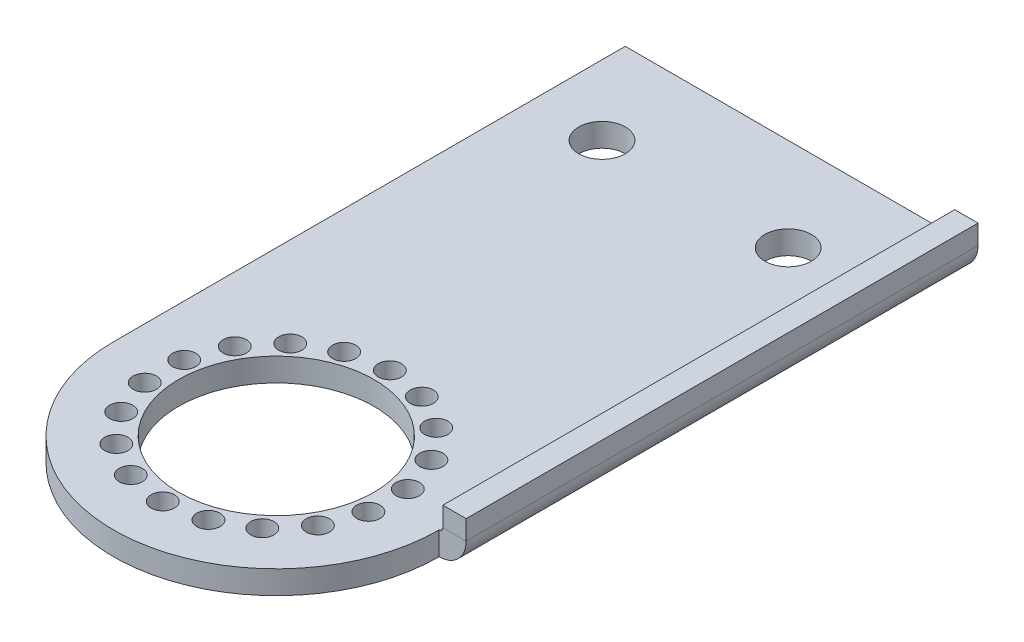
ISO-10303-21;
HEADER;
FILE_DESCRIPTION(('STEP AP214'),'2;1');
FILE_NAME('part.step','',(''),(''),'','','');
FILE_SCHEMA(('AUTOMOTIVE_DESIGN { 1 0 10303 214 1 1 1 1 }'));
ENDSEC;
DATA;
#1=APPLICATION_CONTEXT('core data for automotive mechanical design processes');
#2=APPLICATION_PROTOCOL_DEFINITION('international standard','automotive_design',2000,#1);
#3=PRODUCT_CONTEXT('',#1,'mechanical');
#4=PRODUCT('Part','Part','',(#3));
#5=PRODUCT_RELATED_PRODUCT_CATEGORY('part','',(#4));
#6=PRODUCT_DEFINITION_FORMATION('','',#4);
#7=PRODUCT_DEFINITION_CONTEXT('part definition',#1,'design');
#8=PRODUCT_DEFINITION('design','',#6,#7);
#9=PRODUCT_DEFINITION_SHAPE('','',#8);
#10=(LENGTH_UNIT() NAMED_UNIT(*) SI_UNIT(.MILLI.,.METRE.));
#11=(NAMED_UNIT(*) PLANE_ANGLE_UNIT() SI_UNIT($,.RADIAN.));
#12=(NAMED_UNIT(*) SI_UNIT($,.STERADIAN.) SOLID_ANGLE_UNIT());
#13=UNCERTAINTY_MEASURE_WITH_UNIT(LENGTH_MEASURE(1.E-05),#10,'distance_accuracy_value','');
#14=(GEOMETRIC_REPRESENTATION_CONTEXT(3) GLOBAL_UNCERTAINTY_ASSIGNED_CONTEXT((#13)) GLOBAL_UNIT_ASSIGNED_CONTEXT((#10,
#11,#12)) REPRESENTATION_CONTEXT('',''));
#15=CARTESIAN_POINT('',(0.,0.,0.));
#16=DIRECTION('',(0.,0.,1.));
#17=DIRECTION('',(1.,0.,0.));
#18=AXIS2_PLACEMENT_3D('',#15,#16,#17);
#19=CARTESIAN_POINT('',(22.225,3.175,-69.85));
#20=DIRECTION('',(0.,0.,1.));
#21=DIRECTION('',(-1.,0.,0.));
#22=AXIS2_PLACEMENT_3D('',#19,#20,#21);
#23=PLANE('',#22);
#24=DIRECTION('',(0.,1.,0.));
#25=VECTOR('',#24,1.);
#26=CARTESIAN_POINT('',(22.225,3.175,-69.85));
#27=LINE('',#26,#25);
#28=CARTESIAN_POINT('',(22.225,0.,-69.85));
#29=VERTEX_POINT('',#28);
#30=CARTESIAN_POINT('',(22.225,3.175,-69.85));
#31=VERTEX_POINT('',#30);
#32=EDGE_CURVE('E13',#29,#31,#27,.T.);
#33=ORIENTED_EDGE('',*,*,#32,.F.);
#34=DIRECTION('',(1.,0.,0.));
#35=VECTOR('',#34,1.);
#36=CARTESIAN_POINT('',(0.,0.,-69.85));
#37=LINE('',#36,#35);
#38=CARTESIAN_POINT('',(-22.225,0.,-69.85));
#39=VERTEX_POINT('',#38);
#40=EDGE_CURVE('E98',#29,#39,#37,.F.);
#41=ORIENTED_EDGE('',*,*,#40,.T.);
#42=DIRECTION('',(0.,1.,0.));
#43=VECTOR('',#42,1.);
#44=CARTESIAN_POINT('',(-22.225,3.175,-69.85));
#45=LINE('',#44,#43);
#46=CARTESIAN_POINT('',(-22.225,3.175,-69.85));
#47=VERTEX_POINT('',#46);
#48=EDGE_CURVE('E67',#39,#47,#45,.T.);
#49=ORIENTED_EDGE('',*,*,#48,.T.);
#50=DIRECTION('',(-1.,0.,0.));
#51=VECTOR('',#50,1.);
#52=CARTESIAN_POINT('',(22.225,3.175,-69.85));
#53=LINE('',#52,#51);
#54=EDGE_CURVE('E122',#31,#47,#53,.T.);
#55=ORIENTED_EDGE('',*,*,#54,.F.);
#56=EDGE_LOOP('',(#33,#41,#49,#55));
#57=FACE_BOUND('',#56,.T.);
#58=ADVANCED_FACE('F57',(#57),#23,.F.);
#59=CARTESIAN_POINT('',(-22.225,3.175,-69.85));
#60=DIRECTION('',(1.,0.,0.));
#61=DIRECTION('',(0.,0.,1.));
#62=AXIS2_PLACEMENT_3D('',#59,#60,#61);
#63=PLANE('',#62);
#64=ORIENTED_EDGE('',*,*,#48,.F.);
#65=DIRECTION('',(0.,0.,-1.));
#66=VECTOR('',#65,1.);
#67=CARTESIAN_POINT('',(-22.225,0.,0.));
#68=LINE('',#67,#66);
#69=CARTESIAN_POINT('',(-22.225,0.,0.));
#70=VERTEX_POINT('',#69);
#71=EDGE_CURVE('E282',#39,#70,#68,.F.);
#72=ORIENTED_EDGE('',*,*,#71,.T.);
#73=DIRECTION('',(0.,1.,0.));
#74=VECTOR('',#73,1.);
#75=CARTESIAN_POINT('',(-22.225,3.175,0.));
#76=LINE('',#75,#74);
#77=CARTESIAN_POINT('',(-22.225,3.175,0.));
#78=VERTEX_POINT('',#77);
#79=EDGE_CURVE('E75',#70,#78,#76,.T.);
#80=ORIENTED_EDGE('',*,*,#79,.T.);
#81=DIRECTION('',(0.,0.,1.));
#82=VECTOR('',#81,1.);
#83=CARTESIAN_POINT('',(-22.225,3.175,-69.85));
#84=LINE('',#83,#82);
#85=EDGE_CURVE('E130',#47,#78,#84,.T.);
#86=ORIENTED_EDGE('',*,*,#85,.F.);
#87=EDGE_LOOP('',(#64,#72,#80,#86));
#88=FACE_BOUND('',#87,.T.);
#89=ADVANCED_FACE('F363',(#88),#63,.F.);
#90=CARTESIAN_POINT('',(0.,3.175,0.));
#91=DIRECTION('',(0.,1.,0.));
#92=DIRECTION('',(0.,0.,1.));
#93=AXIS2_PLACEMENT_3D('',#90,#91,#92);
#94=CYLINDRICAL_SURFACE('',#93,22.225);
#95=ORIENTED_EDGE('',*,*,#79,.F.);
#96=CARTESIAN_POINT('',(0.,0.,0.));
#97=DIRECTION('',(0.,1.,0.));
#98=DIRECTION('',(0.,0.,1.));
#99=AXIS2_PLACEMENT_3D('',#96,#97,#98);
#100=CIRCLE('',#99,22.225);
#101=CARTESIAN_POINT('',(22.225,0.,0.));
#102=VERTEX_POINT('',#101);
#103=EDGE_CURVE('E280',#70,#102,#100,.T.);
#104=ORIENTED_EDGE('',*,*,#103,.T.);
#105=DIRECTION('',(0.,1.,0.));
#106=VECTOR('',#105,1.);
#107=CARTESIAN_POINT('',(22.225,3.175,0.));
#108=LINE('',#107,#106);
#109=CARTESIAN_POINT('',(22.225,3.175,0.));
#110=VERTEX_POINT('',#109);
#111=EDGE_CURVE('E61',#102,#110,#108,.T.);
#112=ORIENTED_EDGE('',*,*,#111,.T.);
#113=CARTESIAN_POINT('',(0.,3.175,0.));
#114=DIRECTION('',(0.,1.,0.));
#115=DIRECTION('',(0.,0.,-1.));
#116=AXIS2_PLACEMENT_3D('',#113,#114,#115);
#117=CIRCLE('',#116,22.225);
#118=EDGE_CURVE('E123',#78,#110,#117,.T.);
#119=ORIENTED_EDGE('',*,*,#118,.F.);
#120=EDGE_LOOP('',(#95,#104,#112,#119));
#121=FACE_BOUND('',#120,.T.);
#122=ADVANCED_FACE('F291',(#121),#94,.T.);
#123=CARTESIAN_POINT('',(-5.29926010068765,3.175,-14.5595974664571));
#124=DIRECTION('',(0.,1.,0.));
#125=DIRECTION('',(0.,0.,1.));
#126=AXIS2_PLACEMENT_3D('',#123,#124,#125);
#127=CYLINDRICAL_SURFACE('',#126,1.58749999999753);
#128=CARTESIAN_POINT('',(-5.29926010068765,3.175,-14.5595974664571));
#129=DIRECTION('',(0.,1.,0.));
#130=DIRECTION('',(0.,0.,1.));
#131=AXIS2_PLACEMENT_3D('',#128,#129,#130);
#132=CIRCLE('',#131,1.58749999999753);
#133=CARTESIAN_POINT('',(-5.29926010068765,3.175,-12.9720974664595));
#134=VERTEX_POINT('',#133);
#135=EDGE_CURVE('E153',#134,#134,#132,.T.);
#136=ORIENTED_EDGE('',*,*,#135,.T.);
#137=EDGE_LOOP('',(#136));
#138=FACE_BOUND('',#137,.T.);
#139=CARTESIAN_POINT('',(-5.29926010068765,0.,-14.5595974664571));
#140=DIRECTION('',(0.,1.,0.));
#141=DIRECTION('',(0.,0.,1.));
#142=AXIS2_PLACEMENT_3D('',#139,#140,#141);
#143=CIRCLE('',#142,1.58749999999753);
#144=CARTESIAN_POINT('',(-5.29926010068765,0.,-12.9720974664595));
#145=VERTEX_POINT('',#144);
#146=EDGE_CURVE('E219',#145,#145,#143,.T.);
#147=ORIENTED_EDGE('',*,*,#146,.F.);
#148=EDGE_LOOP('',(#147));
#149=FACE_BOUND('',#148,.T.);
#150=ADVANCED_FACE('F372',(#138,#149),#127,.F.);
#151=CARTESIAN_POINT('',(-9.95935122448306,3.175,-11.8690926016857));
#152=DIRECTION('',(0.,1.,0.));
#153=DIRECTION('',(0.,0.,1.));
#154=AXIS2_PLACEMENT_3D('',#151,#152,#153);
#155=CYLINDRICAL_SURFACE('',#154,1.58749999999747);
#156=CARTESIAN_POINT('',(-9.95935122448306,3.175,-11.8690926016857));
#157=DIRECTION('',(0.,1.,0.));
#158=DIRECTION('',(0.,0.,1.));
#159=AXIS2_PLACEMENT_3D('',#156,#157,#158);
#160=CIRCLE('',#159,1.58749999999747);
#161=CARTESIAN_POINT('',(-9.95935122448306,3.175,-10.2815926016882));
#162=VERTEX_POINT('',#161);
#163=EDGE_CURVE('E156',#162,#162,#160,.T.);
#164=ORIENTED_EDGE('',*,*,#163,.T.);
#165=EDGE_LOOP('',(#164));
#166=FACE_BOUND('',#165,.T.);
#167=CARTESIAN_POINT('',(-9.95935122448306,0.,-11.8690926016857));
#168=DIRECTION('',(0.,1.,0.));
#169=DIRECTION('',(0.,0.,1.));
#170=AXIS2_PLACEMENT_3D('',#167,#168,#169);
#171=CIRCLE('',#170,1.58749999999747);
#172=CARTESIAN_POINT('',(-9.95935122448306,0.,-10.2815926016882));
#173=VERTEX_POINT('',#172);
#174=EDGE_CURVE('E222',#173,#173,#171,.T.);
#175=ORIENTED_EDGE('',*,*,#174,.F.);
#176=EDGE_LOOP('',(#175));
#177=FACE_BOUND('',#176,.T.);
#178=ADVANCED_FACE('F444',(#166,#177),#155,.F.);
#179=CARTESIAN_POINT('',(-13.418197606236,3.175,-7.74700000000019));
#180=DIRECTION('',(0.,1.,0.));
#181=DIRECTION('',(0.,0.,1.));
#182=AXIS2_PLACEMENT_3D('',#179,#180,#181);
#183=CYLINDRICAL_SURFACE('',#182,1.58749999999742);
#184=CARTESIAN_POINT('',(-13.418197606236,3.175,-7.74700000000019));
#185=DIRECTION('',(0.,1.,0.));
#186=DIRECTION('',(0.,0.,1.));
#187=AXIS2_PLACEMENT_3D('',#184,#185,#186);
#188=CIRCLE('',#187,1.58749999999742);
#189=CARTESIAN_POINT('',(-13.418197606236,3.175,-6.15950000000278));
#190=VERTEX_POINT('',#189);
#191=EDGE_CURVE('E160',#190,#190,#188,.T.);
#192=ORIENTED_EDGE('',*,*,#191,.T.);
#193=EDGE_LOOP('',(#192));
#194=FACE_BOUND('',#193,.T.);
#195=CARTESIAN_POINT('',(-13.418197606236,0.,-7.74700000000019));
#196=DIRECTION('',(0.,1.,0.));
#197=DIRECTION('',(0.,0.,1.));
#198=AXIS2_PLACEMENT_3D('',#195,#196,#197);
#199=CIRCLE('',#198,1.58749999999742);
#200=CARTESIAN_POINT('',(-13.418197606236,0.,-6.15950000000278));
#201=VERTEX_POINT('',#200);
#202=EDGE_CURVE('E226',#201,#201,#199,.T.);
#203=ORIENTED_EDGE('',*,*,#202,.F.);
#204=EDGE_LOOP('',(#203));
#205=FACE_BOUND('',#204,.T.);
#206=ADVANCED_FACE('F440',(#194,#205),#183,.F.);
#207=CARTESIAN_POINT('',(-15.2586113251711,3.175,-2.69050486477159));
#208=DIRECTION('',(0.,1.,0.));
#209=DIRECTION('',(0.,0.,1.));
#210=AXIS2_PLACEMENT_3D('',#207,#208,#209);
#211=CYLINDRICAL_SURFACE('',#210,1.58749999999737);
#212=CARTESIAN_POINT('',(-15.2586113251711,3.175,-2.69050486477159));
#213=DIRECTION('',(0.,1.,0.));
#214=DIRECTION('',(0.,0.,1.));
#215=AXIS2_PLACEMENT_3D('',#212,#213,#214);
#216=CIRCLE('',#215,1.58749999999737);
#217=CARTESIAN_POINT('',(-15.2586113251711,3.175,-1.10300486477422));
#218=VERTEX_POINT('',#217);
#219=EDGE_CURVE('E163',#218,#218,#216,.T.);
#220=ORIENTED_EDGE('',*,*,#219,.T.);
#221=EDGE_LOOP('',(#220));
#222=FACE_BOUND('',#221,.T.);
#223=CARTESIAN_POINT('',(-15.2586113251711,0.,-2.69050486477159));
#224=DIRECTION('',(0.,1.,0.));
#225=DIRECTION('',(0.,0.,1.));
#226=AXIS2_PLACEMENT_3D('',#223,#224,#225);
#227=CIRCLE('',#226,1.58749999999737);
#228=CARTESIAN_POINT('',(-15.2586113251711,0.,-1.10300486477422));
#229=VERTEX_POINT('',#228);
#230=EDGE_CURVE('E229',#229,#229,#227,.T.);
#231=ORIENTED_EDGE('',*,*,#230,.F.);
#232=EDGE_LOOP('',(#231));
#233=FACE_BOUND('',#232,.T.);
#234=ADVANCED_FACE('F436',(#222,#233),#211,.F.);
#235=CARTESIAN_POINT('',(-15.2586113251711,3.175,2.69050486477106));
#236=DIRECTION('',(0.,1.,0.));
#237=DIRECTION('',(0.,0.,1.));
#238=AXIS2_PLACEMENT_3D('',#235,#236,#237);
#239=CYLINDRICAL_SURFACE('',#238,1.58749999999733);
#240=CARTESIAN_POINT('',(-15.2586113251711,3.175,2.69050486477106));
#241=DIRECTION('',(0.,1.,0.));
#242=DIRECTION('',(0.,0.,1.));
#243=AXIS2_PLACEMENT_3D('',#240,#241,#242);
#244=CIRCLE('',#243,1.58749999999733);
#245=CARTESIAN_POINT('',(-15.2586113251711,3.175,4.27800486476839));
#246=VERTEX_POINT('',#245);
#247=EDGE_CURVE('E166',#246,#246,#244,.T.);
#248=ORIENTED_EDGE('',*,*,#247,.T.);
#249=EDGE_LOOP('',(#248));
#250=FACE_BOUND('',#249,.T.);
#251=CARTESIAN_POINT('',(-15.2586113251711,0.,2.69050486477106));
#252=DIRECTION('',(0.,1.,0.));
#253=DIRECTION('',(0.,0.,1.));
#254=AXIS2_PLACEMENT_3D('',#251,#252,#253);
#255=CIRCLE('',#254,1.58749999999733);
#256=CARTESIAN_POINT('',(-15.2586113251711,0.,4.27800486476839));
#257=VERTEX_POINT('',#256);
#258=EDGE_CURVE('E232',#257,#257,#255,.T.);
#259=ORIENTED_EDGE('',*,*,#258,.F.);
#260=EDGE_LOOP('',(#259));
#261=FACE_BOUND('',#260,.T.);
#262=ADVANCED_FACE('F432',(#250,#261),#239,.F.);
#263=CARTESIAN_POINT('',(-13.4181976062361,3.175,7.74699999999968));
#264=DIRECTION('',(0.,1.,0.));
#265=DIRECTION('',(0.,0.,1.));
#266=AXIS2_PLACEMENT_3D('',#263,#264,#265);
#267=CYLINDRICAL_SURFACE('',#266,1.58749999999732);
#268=CARTESIAN_POINT('',(-13.4181976062361,3.175,7.74699999999968));
#269=DIRECTION('',(0.,1.,0.));
#270=DIRECTION('',(0.,0.,1.));
#271=AXIS2_PLACEMENT_3D('',#268,#269,#270);
#272=CIRCLE('',#271,1.58749999999732);
#273=CARTESIAN_POINT('',(-13.4181976062361,3.175,9.33449999999699));
#274=VERTEX_POINT('',#273);
#275=EDGE_CURVE('E169',#274,#274,#272,.T.);
#276=ORIENTED_EDGE('',*,*,#275,.T.);
#277=EDGE_LOOP('',(#276));
#278=FACE_BOUND('',#277,.T.);
#279=CARTESIAN_POINT('',(-13.4181976062361,0.,7.74699999999968));
#280=DIRECTION('',(0.,1.,0.));
#281=DIRECTION('',(0.,0.,1.));
#282=AXIS2_PLACEMENT_3D('',#279,#280,#281);
#283=CIRCLE('',#282,1.58749999999732);
#284=CARTESIAN_POINT('',(-13.4181976062361,0.,9.33449999999699));
#285=VERTEX_POINT('',#284);
#286=EDGE_CURVE('E235',#285,#285,#283,.T.);
#287=ORIENTED_EDGE('',*,*,#286,.F.);
#288=EDGE_LOOP('',(#287));
#289=FACE_BOUND('',#288,.T.);
#290=ADVANCED_FACE('F428',(#278,#289),#267,.F.);
#291=CARTESIAN_POINT('',(-9.95935122448335,3.175,11.8690926016852));
#292=DIRECTION('',(0.,1.,0.));
#293=DIRECTION('',(0.,0.,1.));
#294=AXIS2_PLACEMENT_3D('',#291,#292,#293);
#295=CYLINDRICAL_SURFACE('',#294,1.5874999999971);
#296=CARTESIAN_POINT('',(-9.95935122448335,3.175,11.8690926016852));
#297=DIRECTION('',(0.,1.,0.));
#298=DIRECTION('',(0.,0.,1.));
#299=AXIS2_PLACEMENT_3D('',#296,#297,#298);
#300=CIRCLE('',#299,1.5874999999971);
#301=CARTESIAN_POINT('',(-9.95935122448335,3.175,13.4565926016823));
#302=VERTEX_POINT('',#301);
#303=EDGE_CURVE('E172',#302,#302,#300,.T.);
#304=ORIENTED_EDGE('',*,*,#303,.T.);
#305=EDGE_LOOP('',(#304));
#306=FACE_BOUND('',#305,.T.);
#307=CARTESIAN_POINT('',(-9.95935122448335,0.,11.8690926016852));
#308=DIRECTION('',(0.,1.,0.));
#309=DIRECTION('',(0.,0.,1.));
#310=AXIS2_PLACEMENT_3D('',#307,#308,#309);
#311=CIRCLE('',#310,1.5874999999971);
#312=CARTESIAN_POINT('',(-9.95935122448335,0.,13.4565926016823));
#313=VERTEX_POINT('',#312);
#314=EDGE_CURVE('E238',#313,#313,#311,.T.);
#315=ORIENTED_EDGE('',*,*,#314,.F.);
#316=EDGE_LOOP('',(#315));
#317=FACE_BOUND('',#316,.T.);
#318=ADVANCED_FACE('F424',(#306,#317),#295,.F.);
#319=CARTESIAN_POINT('',(-5.29926010068807,3.175,14.5595974664566));
#320=DIRECTION('',(0.,1.,0.));
#321=DIRECTION('',(0.,0.,1.));
#322=AXIS2_PLACEMENT_3D('',#319,#320,#321);
#323=CYLINDRICAL_SURFACE('',#322,1.58749999999709);
#324=CARTESIAN_POINT('',(-5.29926010068807,3.175,14.5595974664566));
#325=DIRECTION('',(0.,1.,0.));
#326=DIRECTION('',(0.,0.,1.));
#327=AXIS2_PLACEMENT_3D('',#324,#325,#326);
#328=CIRCLE('',#327,1.58749999999709);
#329=CARTESIAN_POINT('',(-5.29926010068807,3.175,16.1470974664537));
#330=VERTEX_POINT('',#329);
#331=EDGE_CURVE('E175',#330,#330,#328,.T.);
#332=ORIENTED_EDGE('',*,*,#331,.T.);
#333=EDGE_LOOP('',(#332));
#334=FACE_BOUND('',#333,.T.);
#335=CARTESIAN_POINT('',(-5.29926010068807,0.,14.5595974664566));
#336=DIRECTION('',(0.,1.,0.));
#337=DIRECTION('',(0.,0.,1.));
#338=AXIS2_PLACEMENT_3D('',#335,#336,#337);
#339=CIRCLE('',#338,1.58749999999709);
#340=CARTESIAN_POINT('',(-5.29926010068807,0.,16.1470974664537));
#341=VERTEX_POINT('',#340);
#342=EDGE_CURVE('E241',#341,#341,#339,.T.);
#343=ORIENTED_EDGE('',*,*,#342,.F.);
#344=EDGE_LOOP('',(#343));
#345=FACE_BOUND('',#344,.T.);
#346=ADVANCED_FACE('F420',(#334,#345),#323,.F.);
#347=CARTESIAN_POINT('',(-1.93421667571414E-13,3.175,15.4939999999999));
#348=DIRECTION('',(0.,1.,0.));
#349=DIRECTION('',(0.,0.,1.));
#350=AXIS2_PLACEMENT_3D('',#347,#348,#349);
#351=CYLINDRICAL_SURFACE('',#350,1.58749999999711);
#352=CARTESIAN_POINT('',(-1.93421667571414E-13,3.175,15.4939999999999));
#353=DIRECTION('',(0.,1.,0.));
#354=DIRECTION('',(0.,0.,1.));
#355=AXIS2_PLACEMENT_3D('',#352,#353,#354);
#356=CIRCLE('',#355,1.58749999999711);
#357=CARTESIAN_POINT('',(-1.93421667571414E-13,3.175,17.081499999997));
#358=VERTEX_POINT('',#357);
#359=EDGE_CURVE('E178',#358,#358,#356,.T.);
#360=ORIENTED_EDGE('',*,*,#359,.T.);
#361=EDGE_LOOP('',(#360));
#362=FACE_BOUND('',#361,.T.);
#363=CARTESIAN_POINT('',(-1.93421667571414E-13,0.,15.4939999999999));
#364=DIRECTION('',(0.,1.,0.));
#365=DIRECTION('',(0.,0.,1.));
#366=AXIS2_PLACEMENT_3D('',#363,#364,#365);
#367=CIRCLE('',#366,1.58749999999711);
#368=CARTESIAN_POINT('',(-1.93421667571414E-13,0.,17.081499999997));
#369=VERTEX_POINT('',#368);
#370=EDGE_CURVE('E244',#369,#369,#367,.T.);
#371=ORIENTED_EDGE('',*,*,#370,.F.);
#372=EDGE_LOOP('',(#371));
#373=FACE_BOUND('',#372,.T.);
#374=ADVANCED_FACE('F416',(#362,#373),#351,.F.);
#375=CARTESIAN_POINT('',(5.29926010068774,3.175,14.5595974664569));
#376=DIRECTION('',(0.,1.,0.));
#377=DIRECTION('',(0.,0.,1.));
#378=AXIS2_PLACEMENT_3D('',#375,#376,#377);
#379=CYLINDRICAL_SURFACE('',#378,1.58749999999679);
#380=CARTESIAN_POINT('',(5.29926010068774,3.175,14.5595974664569));
#381=DIRECTION('',(0.,1.,0.));
#382=DIRECTION('',(0.,0.,1.));
#383=AXIS2_PLACEMENT_3D('',#380,#381,#382);
#384=CIRCLE('',#383,1.58749999999679);
#385=CARTESIAN_POINT('',(5.29926010068774,3.175,16.1470974664537));
#386=VERTEX_POINT('',#385);
#387=EDGE_CURVE('E181',#386,#386,#384,.T.);
#388=ORIENTED_EDGE('',*,*,#387,.T.);
#389=EDGE_LOOP('',(#388));
#390=FACE_BOUND('',#389,.T.);
#391=CARTESIAN_POINT('',(5.29926010068774,0.,14.5595974664569));
#392=DIRECTION('',(0.,1.,0.));
#393=DIRECTION('',(0.,0.,1.));
#394=AXIS2_PLACEMENT_3D('',#391,#392,#393);
#395=CIRCLE('',#394,1.58749999999679);
#396=CARTESIAN_POINT('',(5.29926010068774,0.,16.1470974664537));
#397=VERTEX_POINT('',#396);
#398=EDGE_CURVE('E247',#397,#397,#395,.T.);
#399=ORIENTED_EDGE('',*,*,#398,.F.);
#400=EDGE_LOOP('',(#399));
#401=FACE_BOUND('',#400,.T.);
#402=ADVANCED_FACE('F412',(#390,#401),#379,.F.);
#403=CARTESIAN_POINT('',(9.95935122448307,3.175,11.8690926016855));
#404=DIRECTION('',(0.,1.,0.));
#405=DIRECTION('',(0.,0.,1.));
#406=AXIS2_PLACEMENT_3D('',#403,#404,#405);
#407=CYLINDRICAL_SURFACE('',#406,1.5874999999972);
#408=CARTESIAN_POINT('',(9.95935122448307,3.175,11.8690926016855));
#409=DIRECTION('',(0.,1.,0.));
#410=DIRECTION('',(0.,0.,1.));
#411=AXIS2_PLACEMENT_3D('',#408,#409,#410);
#412=CIRCLE('',#411,1.5874999999972);
#413=CARTESIAN_POINT('',(9.95935122448307,3.175,13.4565926016827));
#414=VERTEX_POINT('',#413);
#415=EDGE_CURVE('E184',#414,#414,#412,.T.);
#416=ORIENTED_EDGE('',*,*,#415,.T.);
#417=EDGE_LOOP('',(#416));
#418=FACE_BOUND('',#417,.T.);
#419=CARTESIAN_POINT('',(9.95935122448307,0.,11.8690926016855));
#420=DIRECTION('',(0.,1.,0.));
#421=DIRECTION('',(0.,0.,1.));
#422=AXIS2_PLACEMENT_3D('',#419,#420,#421);
#423=CIRCLE('',#422,1.5874999999972);
#424=CARTESIAN_POINT('',(9.95935122448307,0.,13.4565926016827));
#425=VERTEX_POINT('',#424);
#426=EDGE_CURVE('E250',#425,#425,#423,.T.);
#427=ORIENTED_EDGE('',*,*,#426,.F.);
#428=EDGE_LOOP('',(#427));
#429=FACE_BOUND('',#428,.T.);
#430=ADVANCED_FACE('F408',(#418,#429),#407,.F.);
#431=CARTESIAN_POINT('',(13.418197606236,3.175,7.7470000000001));
#432=DIRECTION('',(0.,1.,0.));
#433=DIRECTION('',(0.,0.,1.));
#434=AXIS2_PLACEMENT_3D('',#431,#432,#433);
#435=CYLINDRICAL_SURFACE('',#434,1.58749999999728);
#436=CARTESIAN_POINT('',(13.418197606236,3.175,7.7470000000001));
#437=DIRECTION('',(0.,1.,0.));
#438=DIRECTION('',(0.,0.,1.));
#439=AXIS2_PLACEMENT_3D('',#436,#437,#438);
#440=CIRCLE('',#439,1.58749999999728);
#441=CARTESIAN_POINT('',(13.418197606236,3.175,9.33449999999738));
#442=VERTEX_POINT('',#441);
#443=EDGE_CURVE('E187',#442,#442,#440,.T.);
#444=ORIENTED_EDGE('',*,*,#443,.T.);
#445=EDGE_LOOP('',(#444));
#446=FACE_BOUND('',#445,.T.);
#447=CARTESIAN_POINT('',(13.418197606236,0.,7.7470000000001));
#448=DIRECTION('',(0.,1.,0.));
#449=DIRECTION('',(0.,0.,1.));
#450=AXIS2_PLACEMENT_3D('',#447,#448,#449);
#451=CIRCLE('',#450,1.58749999999728);
#452=CARTESIAN_POINT('',(13.418197606236,0.,9.33449999999738));
#453=VERTEX_POINT('',#452);
#454=EDGE_CURVE('E253',#453,#453,#451,.T.);
#455=ORIENTED_EDGE('',*,*,#454,.F.);
#456=EDGE_LOOP('',(#455));
#457=FACE_BOUND('',#456,.T.);
#458=ADVANCED_FACE('F404',(#446,#457),#435,.F.);
#459=CARTESIAN_POINT('',(15.2586113251711,3.175,2.69050486477156));
#460=DIRECTION('',(0.,1.,0.));
#461=DIRECTION('',(0.,0.,1.));
#462=AXIS2_PLACEMENT_3D('',#459,#460,#461);
#463=CYLINDRICAL_SURFACE('',#462,1.58749999999736);
#464=CARTESIAN_POINT('',(15.2586113251711,3.175,2.69050486477156));
#465=DIRECTION('',(0.,1.,0.));
#466=DIRECTION('',(0.,0.,1.));
#467=AXIS2_PLACEMENT_3D('',#464,#465,#466);
#468=CIRCLE('',#467,1.58749999999736);
#469=CARTESIAN_POINT('',(15.2586113251711,3.175,4.27800486476892));
#470=VERTEX_POINT('',#469);
#471=EDGE_CURVE('E190',#470,#470,#468,.T.);
#472=ORIENTED_EDGE('',*,*,#471,.T.);
#473=EDGE_LOOP('',(#472));
#474=FACE_BOUND('',#473,.T.);
#475=CARTESIAN_POINT('',(15.2586113251711,0.,2.69050486477156));
#476=DIRECTION('',(0.,1.,0.));
#477=DIRECTION('',(0.,0.,1.));
#478=AXIS2_PLACEMENT_3D('',#475,#476,#477);
#479=CIRCLE('',#478,1.58749999999736);
#480=CARTESIAN_POINT('',(15.2586113251711,0.,4.27800486476892));
#481=VERTEX_POINT('',#480);
#482=EDGE_CURVE('E256',#481,#481,#479,.T.);
#483=ORIENTED_EDGE('',*,*,#482,.F.);
#484=EDGE_LOOP('',(#483));
#485=FACE_BOUND('',#484,.T.);
#486=ADVANCED_FACE('F400',(#474,#485),#463,.F.);
#487=CARTESIAN_POINT('',(15.2586113251712,3.175,-2.69050486477129));
#488=DIRECTION('',(0.,1.,0.));
#489=DIRECTION('',(0.,0.,1.));
#490=AXIS2_PLACEMENT_3D('',#487,#488,#489);
#491=CYLINDRICAL_SURFACE('',#490,1.58749999999742);
#492=CARTESIAN_POINT('',(15.2586113251712,3.175,-2.69050486477129));
#493=DIRECTION('',(0.,1.,0.));
#494=DIRECTION('',(0.,0.,1.));
#495=AXIS2_PLACEMENT_3D('',#492,#493,#494);
#496=CIRCLE('',#495,1.58749999999742);
#497=CARTESIAN_POINT('',(15.2586113251712,3.175,-1.10300486477387));
#498=VERTEX_POINT('',#497);
#499=EDGE_CURVE('E193',#498,#498,#496,.T.);
#500=ORIENTED_EDGE('',*,*,#499,.T.);
#501=EDGE_LOOP('',(#500));
#502=FACE_BOUND('',#501,.T.);
#503=CARTESIAN_POINT('',(15.2586113251712,0.,-2.69050486477129));
#504=DIRECTION('',(0.,1.,0.));
#505=DIRECTION('',(0.,0.,1.));
#506=AXIS2_PLACEMENT_3D('',#503,#504,#505);
#507=CIRCLE('',#506,1.58749999999742);
#508=CARTESIAN_POINT('',(15.2586113251712,0.,-1.10300486477387));
#509=VERTEX_POINT('',#508);
#510=EDGE_CURVE('E259',#509,#509,#507,.T.);
#511=ORIENTED_EDGE('',*,*,#510,.F.);
#512=EDGE_LOOP('',(#511));
#513=FACE_BOUND('',#512,.T.);
#514=ADVANCED_FACE('F396',(#502,#513),#491,.F.);
#515=CARTESIAN_POINT('',(13.4181976062362,3.175,-7.74699999999991));
#516=DIRECTION('',(0.,1.,0.));
#517=DIRECTION('',(0.,0.,1.));
#518=AXIS2_PLACEMENT_3D('',#515,#516,#517);
#519=CYLINDRICAL_SURFACE('',#518,1.5874999999975);
#520=CARTESIAN_POINT('',(13.4181976062362,3.175,-7.74699999999991));
#521=DIRECTION('',(0.,1.,0.));
#522=DIRECTION('',(0.,0.,1.));
#523=AXIS2_PLACEMENT_3D('',#520,#521,#522);
#524=CIRCLE('',#523,1.5874999999975);
#525=CARTESIAN_POINT('',(13.4181976062362,3.175,-6.15950000000241));
#526=VERTEX_POINT('',#525);
#527=EDGE_CURVE('E196',#526,#526,#524,.T.);
#528=ORIENTED_EDGE('',*,*,#527,.T.);
#529=EDGE_LOOP('',(#528));
#530=FACE_BOUND('',#529,.T.);
#531=CARTESIAN_POINT('',(13.4181976062362,0.,-7.74699999999991));
#532=DIRECTION('',(0.,1.,0.));
#533=DIRECTION('',(0.,0.,1.));
#534=AXIS2_PLACEMENT_3D('',#531,#532,#533);
#535=CIRCLE('',#534,1.5874999999975);
#536=CARTESIAN_POINT('',(13.4181976062362,0.,-6.15950000000241));
#537=VERTEX_POINT('',#536);
#538=EDGE_CURVE('E262',#537,#537,#535,.T.);
#539=ORIENTED_EDGE('',*,*,#538,.F.);
#540=EDGE_LOOP('',(#539));
#541=FACE_BOUND('',#540,.T.);
#542=ADVANCED_FACE('F392',(#530,#541),#519,.F.);
#543=CARTESIAN_POINT('',(12.7,3.175,-57.15));
#544=DIRECTION('',(0.,1.,0.));
#545=DIRECTION('',(0.,0.,1.));
#546=AXIS2_PLACEMENT_3D('',#543,#544,#545);
#547=CYLINDRICAL_SURFACE('',#546,3.175);
#548=CARTESIAN_POINT('',(12.7,3.175,-57.15));
#549=DIRECTION('',(0.,1.,0.));
#550=DIRECTION('',(0.,0.,1.));
#551=AXIS2_PLACEMENT_3D('',#548,#549,#550);
#552=CIRCLE('',#551,3.175);
#553=CARTESIAN_POINT('',(12.7,3.175,-53.975));
#554=VERTEX_POINT('',#553);
#555=EDGE_CURVE('E199',#554,#554,#552,.T.);
#556=ORIENTED_EDGE('',*,*,#555,.T.);
#557=EDGE_LOOP('',(#556));
#558=FACE_BOUND('',#557,.T.);
#559=CARTESIAN_POINT('',(12.7,0.,-57.15));
#560=DIRECTION('',(0.,1.,0.));
#561=DIRECTION('',(0.,0.,1.));
#562=AXIS2_PLACEMENT_3D('',#559,#560,#561);
#563=CIRCLE('',#562,3.175);
#564=CARTESIAN_POINT('',(12.7,0.,-53.975));
#565=VERTEX_POINT('',#564);
#566=EDGE_CURVE('E265',#565,#565,#563,.T.);
#567=ORIENTED_EDGE('',*,*,#566,.F.);
#568=EDGE_LOOP('',(#567));
#569=FACE_BOUND('',#568,.T.);
#570=ADVANCED_FACE('F388',(#558,#569),#547,.F.);
#571=CARTESIAN_POINT('',(0.,3.175,-15.4940000000001));
#572=DIRECTION('',(0.,1.,0.));
#573=DIRECTION('',(0.,0.,1.));
#574=AXIS2_PLACEMENT_3D('',#571,#572,#573);
#575=CYLINDRICAL_SURFACE('',#574,1.58749999999936);
#576=CARTESIAN_POINT('',(0.,3.175,-15.4940000000001));
#577=DIRECTION('',(0.,1.,0.));
#578=DIRECTION('',(0.,0.,1.));
#579=AXIS2_PLACEMENT_3D('',#576,#577,#578);
#580=CIRCLE('',#579,1.58749999999936);
#581=CARTESIAN_POINT('',(0.,3.175,-13.9065000000008));
#582=VERTEX_POINT('',#581);
#583=EDGE_CURVE('E202',#582,#582,#580,.T.);
#584=ORIENTED_EDGE('',*,*,#583,.T.);
#585=EDGE_LOOP('',(#584));
#586=FACE_BOUND('',#585,.T.);
#587=CARTESIAN_POINT('',(0.,0.,-15.4940000000001));
#588=DIRECTION('',(0.,1.,0.));
#589=DIRECTION('',(0.,0.,1.));
#590=AXIS2_PLACEMENT_3D('',#587,#588,#589);
#591=CIRCLE('',#590,1.58749999999936);
#592=CARTESIAN_POINT('',(0.,0.,-13.9065000000008));
#593=VERTEX_POINT('',#592);
#594=EDGE_CURVE('E268',#593,#593,#591,.T.);
#595=ORIENTED_EDGE('',*,*,#594,.F.);
#596=EDGE_LOOP('',(#595));
#597=FACE_BOUND('',#596,.T.);
#598=ADVANCED_FACE('F384',(#586,#597),#575,.F.);
#599=CARTESIAN_POINT('',(5.29926010068814,3.175,-14.5595974664569));
#600=DIRECTION('',(0.,1.,0.));
#601=DIRECTION('',(0.,0.,1.));
#602=AXIS2_PLACEMENT_3D('',#599,#600,#601);
#603=CYLINDRICAL_SURFACE('',#602,1.58749999999758);
#604=CARTESIAN_POINT('',(5.29926010068814,3.175,-14.5595974664569));
#605=DIRECTION('',(0.,1.,0.));
#606=DIRECTION('',(0.,0.,1.));
#607=AXIS2_PLACEMENT_3D('',#604,#605,#606);
#608=CIRCLE('',#607,1.58749999999758);
#609=CARTESIAN_POINT('',(5.29926010068814,3.175,-12.9720974664594));
#610=VERTEX_POINT('',#609);
#611=EDGE_CURVE('E205',#610,#610,#608,.T.);
#612=ORIENTED_EDGE('',*,*,#611,.T.);
#613=EDGE_LOOP('',(#612));
#614=FACE_BOUND('',#613,.T.);
#615=CARTESIAN_POINT('',(5.29926010068814,0.,-14.5595974664569));
#616=DIRECTION('',(0.,1.,0.));
#617=DIRECTION('',(0.,0.,1.));
#618=AXIS2_PLACEMENT_3D('',#615,#616,#617);
#619=CIRCLE('',#618,1.58749999999758);
#620=CARTESIAN_POINT('',(5.29926010068814,0.,-12.9720974664594));
#621=VERTEX_POINT('',#620);
#622=EDGE_CURVE('E271',#621,#621,#619,.T.);
#623=ORIENTED_EDGE('',*,*,#622,.F.);
#624=EDGE_LOOP('',(#623));
#625=FACE_BOUND('',#624,.T.);
#626=ADVANCED_FACE('F380',(#614,#625),#603,.F.);
#627=CARTESIAN_POINT('',(9.95935122448345,3.175,-11.8690926016854));
#628=DIRECTION('',(0.,1.,0.));
#629=DIRECTION('',(0.,0.,1.));
#630=AXIS2_PLACEMENT_3D('',#627,#628,#629);
#631=CYLINDRICAL_SURFACE('',#630,1.58749999999754);
#632=CARTESIAN_POINT('',(9.95935122448345,3.175,-11.8690926016854));
#633=DIRECTION('',(0.,1.,0.));
#634=DIRECTION('',(0.,0.,1.));
#635=AXIS2_PLACEMENT_3D('',#632,#633,#634);
#636=CIRCLE('',#635,1.58749999999754);
#637=CARTESIAN_POINT('',(9.95935122448345,3.175,-10.2815926016879));
#638=VERTEX_POINT('',#637);
#639=EDGE_CURVE('E208',#638,#638,#636,.T.);
#640=ORIENTED_EDGE('',*,*,#639,.T.);
#641=EDGE_LOOP('',(#640));
#642=FACE_BOUND('',#641,.T.);
#643=CARTESIAN_POINT('',(9.95935122448345,0.,-11.8690926016854));
#644=DIRECTION('',(0.,1.,0.));
#645=DIRECTION('',(0.,0.,1.));
#646=AXIS2_PLACEMENT_3D('',#643,#644,#645);
#647=CIRCLE('',#646,1.58749999999754);
#648=CARTESIAN_POINT('',(9.95935122448345,0.,-10.2815926016879));
#649=VERTEX_POINT('',#648);
#650=EDGE_CURVE('E274',#649,#649,#647,.T.);
#651=ORIENTED_EDGE('',*,*,#650,.F.);
#652=EDGE_LOOP('',(#651));
#653=FACE_BOUND('',#652,.T.);
#654=ADVANCED_FACE('F376',(#642,#653),#631,.F.);
#655=CARTESIAN_POINT('',(-12.7,3.175,-57.15));
#656=DIRECTION('',(0.,1.,0.));
#657=DIRECTION('',(0.,0.,1.));
#658=AXIS2_PLACEMENT_3D('',#655,#656,#657);
#659=CYLINDRICAL_SURFACE('',#658,3.175);
#660=CARTESIAN_POINT('',(-12.7,3.175,-57.15));
#661=DIRECTION('',(0.,1.,0.));
#662=DIRECTION('',(0.,0.,1.));
#663=AXIS2_PLACEMENT_3D('',#660,#661,#662);
#664=CIRCLE('',#663,3.175);
#665=CARTESIAN_POINT('',(-12.7,3.175,-53.975));
#666=VERTEX_POINT('',#665);
#667=EDGE_CURVE('E211',#666,#666,#664,.T.);
#668=ORIENTED_EDGE('',*,*,#667,.T.);
#669=EDGE_LOOP('',(#668));
#670=FACE_BOUND('',#669,.T.);
#671=CARTESIAN_POINT('',(-12.7,0.,-57.15));
#672=DIRECTION('',(0.,1.,0.));
#673=DIRECTION('',(0.,0.,1.));
#674=AXIS2_PLACEMENT_3D('',#671,#672,#673);
#675=CIRCLE('',#674,3.175);
#676=CARTESIAN_POINT('',(-12.7,0.,-53.975));
#677=VERTEX_POINT('',#676);
#678=EDGE_CURVE('E277',#677,#677,#675,.T.);
#679=ORIENTED_EDGE('',*,*,#678,.F.);
#680=EDGE_LOOP('',(#679));
#681=FACE_BOUND('',#680,.T.);
#682=ADVANCED_FACE('F373',(#670,#681),#659,.F.);
#683=CARTESIAN_POINT('',(0.,3.175,0.));
#684=DIRECTION('',(0.,1.,0.));
#685=DIRECTION('',(0.,0.,1.));
#686=AXIS2_PLACEMENT_3D('',#683,#684,#685);
#687=CYLINDRICAL_SURFACE('',#686,13.335);
#688=CARTESIAN_POINT('',(0.,3.175,0.));
#689=DIRECTION('',(0.,1.,0.));
#690=DIRECTION('',(0.,0.,1.));
#691=AXIS2_PLACEMENT_3D('',#688,#689,#690);
#692=CIRCLE('',#691,13.335);
#693=CARTESIAN_POINT('',(0.,3.175,13.335));
#694=VERTEX_POINT('',#693);
#695=EDGE_CURVE('E216',#694,#694,#692,.T.);
#696=ORIENTED_EDGE('',*,*,#695,.T.);
#697=EDGE_LOOP('',(#696));
#698=FACE_BOUND('',#697,.T.);
#699=CARTESIAN_POINT('',(0.,0.,0.));
#700=DIRECTION('',(0.,1.,0.));
#701=DIRECTION('',(0.,0.,1.));
#702=AXIS2_PLACEMENT_3D('',#699,#700,#701);
#703=CIRCLE('',#702,13.335);
#704=CARTESIAN_POINT('',(0.,0.,13.335));
#705=VERTEX_POINT('',#704);
#706=EDGE_CURVE('E157',#705,#705,#703,.T.);
#707=ORIENTED_EDGE('',*,*,#706,.F.);
#708=EDGE_LOOP('',(#707));
#709=FACE_BOUND('',#708,.T.);
#710=ADVANCED_FACE('F59',(#698,#709),#687,.F.);
#711=CARTESIAN_POINT('',(0.,3.175,0.));
#712=DIRECTION('',(0.,-1.,0.));
#713=DIRECTION('',(0.,0.,-1.));
#714=AXIS2_PLACEMENT_3D('',#711,#712,#713);
#715=PLANE('',#714);
#716=ORIENTED_EDGE('',*,*,#135,.F.);
#717=EDGE_LOOP('',(#716));
#718=FACE_BOUND('',#717,.T.);
#719=ORIENTED_EDGE('',*,*,#163,.F.);
#720=EDGE_LOOP('',(#719));
#721=FACE_BOUND('',#720,.T.);
#722=ORIENTED_EDGE('',*,*,#191,.F.);
#723=EDGE_LOOP('',(#722));
#724=FACE_BOUND('',#723,.T.);
#725=ORIENTED_EDGE('',*,*,#219,.F.);
#726=EDGE_LOOP('',(#725));
#727=FACE_BOUND('',#726,.T.);
#728=ORIENTED_EDGE('',*,*,#247,.F.);
#729=EDGE_LOOP('',(#728));
#730=FACE_BOUND('',#729,.T.);
#731=ORIENTED_EDGE('',*,*,#275,.F.);
#732=EDGE_LOOP('',(#731));
#733=FACE_BOUND('',#732,.T.);
#734=ORIENTED_EDGE('',*,*,#303,.F.);
#735=EDGE_LOOP('',(#734));
#736=FACE_BOUND('',#735,.T.);
#737=ORIENTED_EDGE('',*,*,#331,.F.);
#738=EDGE_LOOP('',(#737));
#739=FACE_BOUND('',#738,.T.);
#740=ORIENTED_EDGE('',*,*,#359,.F.);
#741=EDGE_LOOP('',(#740));
#742=FACE_BOUND('',#741,.T.);
#743=ORIENTED_EDGE('',*,*,#387,.F.);
#744=EDGE_LOOP('',(#743));
#745=FACE_BOUND('',#744,.T.);
#746=ORIENTED_EDGE('',*,*,#415,.F.);
#747=EDGE_LOOP('',(#746));
#748=FACE_BOUND('',#747,.T.);
#749=ORIENTED_EDGE('',*,*,#443,.F.);
#750=EDGE_LOOP('',(#749));
#751=FACE_BOUND('',#750,.T.);
#752=ORIENTED_EDGE('',*,*,#471,.F.);
#753=EDGE_LOOP('',(#752));
#754=FACE_BOUND('',#753,.T.);
#755=ORIENTED_EDGE('',*,*,#499,.F.);
#756=EDGE_LOOP('',(#755));
#757=FACE_BOUND('',#756,.T.);
#758=ORIENTED_EDGE('',*,*,#527,.F.);
#759=EDGE_LOOP('',(#758));
#760=FACE_BOUND('',#759,.T.);
#761=ORIENTED_EDGE('',*,*,#555,.F.);
#762=EDGE_LOOP('',(#761));
#763=FACE_BOUND('',#762,.T.);
#764=ORIENTED_EDGE('',*,*,#583,.F.);
#765=EDGE_LOOP('',(#764));
#766=FACE_BOUND('',#765,.T.);
#767=ORIENTED_EDGE('',*,*,#611,.F.);
#768=EDGE_LOOP('',(#767));
#769=FACE_BOUND('',#768,.T.);
#770=ORIENTED_EDGE('',*,*,#639,.F.);
#771=EDGE_LOOP('',(#770));
#772=FACE_BOUND('',#771,.T.);
#773=ORIENTED_EDGE('',*,*,#667,.F.);
#774=EDGE_LOOP('',(#773));
#775=FACE_BOUND('',#774,.T.);
#776=ORIENTED_EDGE('',*,*,#118,.T.);
#777=DIRECTION('',(0.,0.,-1.));
#778=VECTOR('',#777,1.);
#779=CARTESIAN_POINT('',(22.225,3.175,0.));
#780=LINE('',#779,#778);
#781=EDGE_CURVE('E117',#110,#31,#780,.T.);
#782=ORIENTED_EDGE('',*,*,#781,.T.);
#783=ORIENTED_EDGE('',*,*,#54,.T.);
#784=ORIENTED_EDGE('',*,*,#85,.T.);
#785=EDGE_LOOP('',(#776,#782,#783,#784));
#786=FACE_BOUND('',#785,.T.);
#787=ORIENTED_EDGE('',*,*,#695,.F.);
#788=EDGE_LOOP('',(#787));
#789=FACE_BOUND('',#788,.T.);
#790=ADVANCED_FACE('F119',(#718,#721,#724,#727,#730,#733,#736,#739,#742,#745,#748,#751,#754,
#757,#760,#763,#766,#769,#772,#775,#786,#789),#715,.F.);
#791=CARTESIAN_POINT('',(0.,0.,0.));
#792=DIRECTION('',(0.,-1.,0.));
#793=DIRECTION('',(0.,0.,-1.));
#794=AXIS2_PLACEMENT_3D('',#791,#792,#793);
#795=PLANE('',#794);
#796=ORIENTED_EDGE('',*,*,#146,.T.);
#797=EDGE_LOOP('',(#796));
#798=FACE_BOUND('',#797,.T.);
#799=ORIENTED_EDGE('',*,*,#174,.T.);
#800=EDGE_LOOP('',(#799));
#801=FACE_BOUND('',#800,.T.);
#802=ORIENTED_EDGE('',*,*,#202,.T.);
#803=EDGE_LOOP('',(#802));
#804=FACE_BOUND('',#803,.T.);
#805=ORIENTED_EDGE('',*,*,#230,.T.);
#806=EDGE_LOOP('',(#805));
#807=FACE_BOUND('',#806,.T.);
#808=ORIENTED_EDGE('',*,*,#258,.T.);
#809=EDGE_LOOP('',(#808));
#810=FACE_BOUND('',#809,.T.);
#811=ORIENTED_EDGE('',*,*,#286,.T.);
#812=EDGE_LOOP('',(#811));
#813=FACE_BOUND('',#812,.T.);
#814=ORIENTED_EDGE('',*,*,#314,.T.);
#815=EDGE_LOOP('',(#814));
#816=FACE_BOUND('',#815,.T.);
#817=ORIENTED_EDGE('',*,*,#342,.T.);
#818=EDGE_LOOP('',(#817));
#819=FACE_BOUND('',#818,.T.);
#820=ORIENTED_EDGE('',*,*,#370,.T.);
#821=EDGE_LOOP('',(#820));
#822=FACE_BOUND('',#821,.T.);
#823=ORIENTED_EDGE('',*,*,#398,.T.);
#824=EDGE_LOOP('',(#823));
#825=FACE_BOUND('',#824,.T.);
#826=ORIENTED_EDGE('',*,*,#426,.T.);
#827=EDGE_LOOP('',(#826));
#828=FACE_BOUND('',#827,.T.);
#829=ORIENTED_EDGE('',*,*,#454,.T.);
#830=EDGE_LOOP('',(#829));
#831=FACE_BOUND('',#830,.T.);
#832=ORIENTED_EDGE('',*,*,#482,.T.);
#833=EDGE_LOOP('',(#832));
#834=FACE_BOUND('',#833,.T.);
#835=ORIENTED_EDGE('',*,*,#510,.T.);
#836=EDGE_LOOP('',(#835));
#837=FACE_BOUND('',#836,.T.);
#838=ORIENTED_EDGE('',*,*,#538,.T.);
#839=EDGE_LOOP('',(#838));
#840=FACE_BOUND('',#839,.T.);
#841=ORIENTED_EDGE('',*,*,#566,.T.);
#842=EDGE_LOOP('',(#841));
#843=FACE_BOUND('',#842,.T.);
#844=ORIENTED_EDGE('',*,*,#594,.T.);
#845=EDGE_LOOP('',(#844));
#846=FACE_BOUND('',#845,.T.);
#847=ORIENTED_EDGE('',*,*,#622,.T.);
#848=EDGE_LOOP('',(#847));
#849=FACE_BOUND('',#848,.T.);
#850=ORIENTED_EDGE('',*,*,#650,.T.);
#851=EDGE_LOOP('',(#850));
#852=FACE_BOUND('',#851,.T.);
#853=ORIENTED_EDGE('',*,*,#678,.T.);
#854=EDGE_LOOP('',(#853));
#855=FACE_BOUND('',#854,.T.);
#856=ORIENTED_EDGE('',*,*,#103,.F.);
#857=ORIENTED_EDGE('',*,*,#71,.F.);
#858=ORIENTED_EDGE('',*,*,#40,.F.);
#859=DIRECTION('',(0.,0.,-1.));
#860=VECTOR('',#859,1.);
#861=CARTESIAN_POINT('',(22.225,0.,0.));
#862=LINE('',#861,#860);
#863=EDGE_CURVE('E93',#102,#29,#862,.T.);
#864=ORIENTED_EDGE('',*,*,#863,.F.);
#865=EDGE_LOOP('',(#856,#857,#858,#864));
#866=FACE_BOUND('',#865,.T.);
#867=ORIENTED_EDGE('',*,*,#706,.T.);
#868=EDGE_LOOP('',(#867));
#869=FACE_BOUND('',#868,.T.);
#870=ADVANCED_FACE('F452',(#798,#801,#804,#807,#810,#813,#816,#819,#822,#825,#828,#831,#834,
#837,#840,#843,#846,#849,#852,#855,#866,#869),#795,.T.);
#871=CARTESIAN_POINT('',(22.225,3.683,0.));
#872=DIRECTION('',(0.,0.,1.));
#873=DIRECTION('',(1.,0.,0.));
#874=AXIS2_PLACEMENT_3D('',#871,#872,#873);
#875=PLANE('',#874);
#876=DIRECTION('',(-1.,0.,0.));
#877=VECTOR('',#876,1.);
#878=CARTESIAN_POINT('',(25.908,3.68299999999999,0.));
#879=LINE('',#878,#877);
#880=CARTESIAN_POINT('',(22.733,3.683,0.));
#881=VERTEX_POINT('',#880);
#882=CARTESIAN_POINT('',(25.908,3.68299999999999,0.));
#883=VERTEX_POINT('',#882);
#884=EDGE_CURVE('E303',#881,#883,#879,.F.);
#885=ORIENTED_EDGE('',*,*,#884,.F.);
#886=CARTESIAN_POINT('',(22.225,3.683,0.));
#887=DIRECTION('',(0.,0.,-1.));
#888=DIRECTION('',(-1.,0.,0.));
#889=AXIS2_PLACEMENT_3D('',#886,#887,#888);
#890=CIRCLE('',#889,0.508000000000002);
#891=EDGE_CURVE('E144',#110,#881,#890,.F.);
#892=ORIENTED_EDGE('',*,*,#891,.F.);
#893=ORIENTED_EDGE('',*,*,#111,.F.);
#894=CARTESIAN_POINT('',(22.225,3.683,0.));
#895=DIRECTION('',(0.,0.,-1.));
#896=DIRECTION('',(-1.,0.,0.));
#897=AXIS2_PLACEMENT_3D('',#894,#895,#896);
#898=CIRCLE('',#897,3.683);
#899=EDGE_CURVE('E223',#102,#883,#898,.F.);
#900=ORIENTED_EDGE('',*,*,#899,.T.);
#901=EDGE_LOOP('',(#885,#892,#893,#900));
#902=FACE_BOUND('',#901,.T.);
#903=ADVANCED_FACE('F295',(#902),#875,.T.);
#904=CARTESIAN_POINT('',(22.225,3.683,-69.85));
#905=DIRECTION('',(0.,0.,1.));
#906=DIRECTION('',(1.,0.,0.));
#907=AXIS2_PLACEMENT_3D('',#904,#905,#906);
#908=PLANE('',#907);
#909=CARTESIAN_POINT('',(22.225,3.683,-69.85));
#910=DIRECTION('',(0.,0.,-1.));
#911=DIRECTION('',(-1.,0.,0.));
#912=AXIS2_PLACEMENT_3D('',#909,#910,#911);
#913=CIRCLE('',#912,0.508000000000002);
#914=CARTESIAN_POINT('',(22.733,3.683,-69.85));
#915=VERTEX_POINT('',#914);
#916=EDGE_CURVE('E137',#915,#31,#913,.T.);
#917=ORIENTED_EDGE('',*,*,#916,.F.);
#918=DIRECTION('',(-1.,0.,0.));
#919=VECTOR('',#918,1.);
#920=CARTESIAN_POINT('',(22.733,3.683,-69.85));
#921=LINE('',#920,#919);
#922=CARTESIAN_POINT('',(25.908,3.68299999999999,-69.85));
#923=VERTEX_POINT('',#922);
#924=EDGE_CURVE('E306',#915,#923,#921,.F.);
#925=ORIENTED_EDGE('',*,*,#924,.T.);
#926=CARTESIAN_POINT('',(22.225,3.683,-69.85));
#927=DIRECTION('',(0.,0.,-1.));
#928=DIRECTION('',(-1.,0.,0.));
#929=AXIS2_PLACEMENT_3D('',#926,#927,#928);
#930=CIRCLE('',#929,3.683);
#931=EDGE_CURVE('E140',#923,#29,#930,.T.);
#932=ORIENTED_EDGE('',*,*,#931,.T.);
#933=ORIENTED_EDGE('',*,*,#32,.T.);
#934=EDGE_LOOP('',(#917,#925,#932,#933));
#935=FACE_BOUND('',#934,.T.);
#936=ADVANCED_FACE('F135',(#935),#908,.F.);
#937=CARTESIAN_POINT('',(22.225,3.683,-69.85));
#938=DIRECTION('',(0.,0.,-1.));
#939=DIRECTION('',(1.,0.,0.));
#940=AXIS2_PLACEMENT_3D('',#937,#938,#939);
#941=CYLINDRICAL_SURFACE('',#940,3.683);
#942=ORIENTED_EDGE('',*,*,#863,.T.);
#943=ORIENTED_EDGE('',*,*,#931,.F.);
#944=DIRECTION('',(0.,0.,-1.));
#945=VECTOR('',#944,1.);
#946=CARTESIAN_POINT('',(25.908,3.68299999999999,0.));
#947=LINE('',#946,#945);
#948=EDGE_CURVE('E300',#923,#883,#947,.F.);
#949=ORIENTED_EDGE('',*,*,#948,.T.);
#950=ORIENTED_EDGE('',*,*,#899,.F.);
#951=EDGE_LOOP('',(#942,#943,#949,#950));
#952=FACE_BOUND('',#951,.T.);
#953=ADVANCED_FACE('F298',(#952),#941,.T.);
#954=CARTESIAN_POINT('',(22.225,3.683,-69.85));
#955=DIRECTION('',(0.,0.,-1.));
#956=DIRECTION('',(1.,0.,0.));
#957=AXIS2_PLACEMENT_3D('',#954,#955,#956);
#958=CYLINDRICAL_SURFACE('',#957,0.508000000000002);
#959=ORIENTED_EDGE('',*,*,#781,.F.);
#960=ORIENTED_EDGE('',*,*,#891,.T.);
#961=DIRECTION('',(0.,0.,-1.));
#962=VECTOR('',#961,1.);
#963=CARTESIAN_POINT('',(22.733,3.683,0.));
#964=LINE('',#963,#962);
#965=EDGE_CURVE('E143',#881,#915,#964,.T.);
#966=ORIENTED_EDGE('',*,*,#965,.T.);
#967=ORIENTED_EDGE('',*,*,#916,.T.);
#968=EDGE_LOOP('',(#959,#960,#966,#967));
#969=FACE_BOUND('',#968,.T.);
#970=ADVANCED_FACE('F141',(#969),#958,.F.);
#971=CARTESIAN_POINT('',(25.908,3.17499999999999,0.));
#972=DIRECTION('',(0.,0.,-1.));
#973=DIRECTION('',(-1.,0.,0.));
#974=AXIS2_PLACEMENT_3D('',#971,#972,#973);
#975=PLANE('',#974);
#976=ORIENTED_EDGE('',*,*,#884,.T.);
#977=DIRECTION('',(0.,-1.,0.));
#978=VECTOR('',#977,1.);
#979=CARTESIAN_POINT('',(25.908,0.,0.));
#980=LINE('',#979,#978);
#981=CARTESIAN_POINT('',(25.908,6.35,0.));
#982=VERTEX_POINT('',#981);
#983=EDGE_CURVE('E318',#982,#883,#980,.T.);
#984=ORIENTED_EDGE('',*,*,#983,.F.);
#985=DIRECTION('',(-1.,0.,0.));
#986=VECTOR('',#985,1.);
#987=CARTESIAN_POINT('',(25.908,6.35,0.));
#988=LINE('',#987,#986);
#989=CARTESIAN_POINT('',(22.733,6.35000000000001,0.));
#990=VERTEX_POINT('',#989);
#991=EDGE_CURVE('E149',#982,#990,#988,.T.);
#992=ORIENTED_EDGE('',*,*,#991,.T.);
#993=DIRECTION('',(0.,1.,0.));
#994=VECTOR('',#993,1.);
#995=CARTESIAN_POINT('',(22.733,3.175,0.));
#996=LINE('',#995,#994);
#997=EDGE_CURVE('E309',#990,#881,#996,.F.);
#998=ORIENTED_EDGE('',*,*,#997,.T.);
#999=EDGE_LOOP('',(#976,#984,#992,#998));
#1000=FACE_BOUND('',#999,.T.);
#1001=ADVANCED_FACE('F333',(#1000),#975,.F.);
#1002=CARTESIAN_POINT('',(25.908,6.35,-69.85));
#1003=DIRECTION('',(0.,0.,1.));
#1004=DIRECTION('',(1.,0.,0.));
#1005=AXIS2_PLACEMENT_3D('',#1002,#1003,#1004);
#1006=PLANE('',#1005);
#1007=ORIENTED_EDGE('',*,*,#924,.F.);
#1008=DIRECTION('',(0.,-1.,0.));
#1009=VECTOR('',#1008,1.);
#1010=CARTESIAN_POINT('',(22.733,6.35000000000001,-69.85));
#1011=LINE('',#1010,#1009);
#1012=CARTESIAN_POINT('',(22.733,6.35000000000001,-69.85));
#1013=VERTEX_POINT('',#1012);
#1014=EDGE_CURVE('E312',#915,#1013,#1011,.F.);
#1015=ORIENTED_EDGE('',*,*,#1014,.T.);
#1016=DIRECTION('',(-1.,0.,0.));
#1017=VECTOR('',#1016,1.);
#1018=CARTESIAN_POINT('',(25.908,6.35,-69.85));
#1019=LINE('',#1018,#1017);
#1020=CARTESIAN_POINT('',(25.908,6.35,-69.85));
#1021=VERTEX_POINT('',#1020);
#1022=EDGE_CURVE('E145',#1021,#1013,#1019,.T.);
#1023=ORIENTED_EDGE('',*,*,#1022,.F.);
#1024=DIRECTION('',(0.,1.,0.));
#1025=VECTOR('',#1024,1.);
#1026=CARTESIAN_POINT('',(25.908,0.,-69.85));
#1027=LINE('',#1026,#1025);
#1028=EDGE_CURVE('E321',#923,#1021,#1027,.T.);
#1029=ORIENTED_EDGE('',*,*,#1028,.F.);
#1030=EDGE_LOOP('',(#1007,#1015,#1023,#1029));
#1031=FACE_BOUND('',#1030,.T.);
#1032=ADVANCED_FACE('F345',(#1031),#1006,.F.);
#1033=CARTESIAN_POINT('',(25.908,0.,0.));
#1034=DIRECTION('',(-1.,0.,0.));
#1035=DIRECTION('',(0.,-1.,0.));
#1036=AXIS2_PLACEMENT_3D('',#1033,#1034,#1035);
#1037=PLANE('',#1036);
#1038=ORIENTED_EDGE('',*,*,#948,.F.);
#1039=ORIENTED_EDGE('',*,*,#1028,.T.);
#1040=DIRECTION('',(0.,0.,1.));
#1041=VECTOR('',#1040,1.);
#1042=CARTESIAN_POINT('',(25.908,6.35,0.));
#1043=LINE('',#1042,#1041);
#1044=EDGE_CURVE('E324',#1021,#982,#1043,.T.);
#1045=ORIENTED_EDGE('',*,*,#1044,.T.);
#1046=ORIENTED_EDGE('',*,*,#983,.T.);
#1047=EDGE_LOOP('',(#1038,#1039,#1045,#1046));
#1048=FACE_BOUND('',#1047,.T.);
#1049=ADVANCED_FACE('F352',(#1048),#1037,.F.);
#1050=CARTESIAN_POINT('',(22.733,0.,0.));
#1051=DIRECTION('',(-1.,0.,0.));
#1052=DIRECTION('',(0.,-1.,0.));
#1053=AXIS2_PLACEMENT_3D('',#1050,#1051,#1052);
#1054=PLANE('',#1053);
#1055=ORIENTED_EDGE('',*,*,#1014,.F.);
#1056=ORIENTED_EDGE('',*,*,#965,.F.);
#1057=ORIENTED_EDGE('',*,*,#997,.F.);
#1058=DIRECTION('',(0.,0.,-1.));
#1059=VECTOR('',#1058,1.);
#1060=CARTESIAN_POINT('',(22.733,6.35000000000001,0.));
#1061=LINE('',#1060,#1059);
#1062=EDGE_CURVE('E315',#1013,#990,#1061,.F.);
#1063=ORIENTED_EDGE('',*,*,#1062,.F.);
#1064=EDGE_LOOP('',(#1055,#1056,#1057,#1063));
#1065=FACE_BOUND('',#1064,.T.);
#1066=ADVANCED_FACE('F342',(#1065),#1054,.T.);
#1067=CARTESIAN_POINT('',(25.908,6.35,0.));
#1068=DIRECTION('',(0.,-1.,0.));
#1069=DIRECTION('',(1.,0.,0.));
#1070=AXIS2_PLACEMENT_3D('',#1067,#1068,#1069);
#1071=PLANE('',#1070);
#1072=ORIENTED_EDGE('',*,*,#1062,.T.);
#1073=ORIENTED_EDGE('',*,*,#991,.F.);
#1074=ORIENTED_EDGE('',*,*,#1044,.F.);
#1075=ORIENTED_EDGE('',*,*,#1022,.T.);
#1076=EDGE_LOOP('',(#1072,#1073,#1074,#1075));
#1077=FACE_BOUND('',#1076,.T.);
#1078=ADVANCED_FACE('F349',(#1077),#1071,.F.);
#1079=CLOSED_SHELL('',(#58,#89,#122,#150,#178,#206,#234,#262,#290,#318,#346,#374,#402,#430,#458,
#486,#514,#542,#570,#598,#626,#654,#682,#710,#790,#870,#903,#936,#953,#970,#1001,#1032,#1049,
#1066,#1078));
#1080=MANIFOLD_SOLID_BREP('B2',#1079);
#1081=ADVANCED_BREP_SHAPE_REPRESENTATION('',(#18,#1080),#14);
#1082=SHAPE_DEFINITION_REPRESENTATION(#9,#1081);
ENDSEC;
END-ISO-10303-21;
